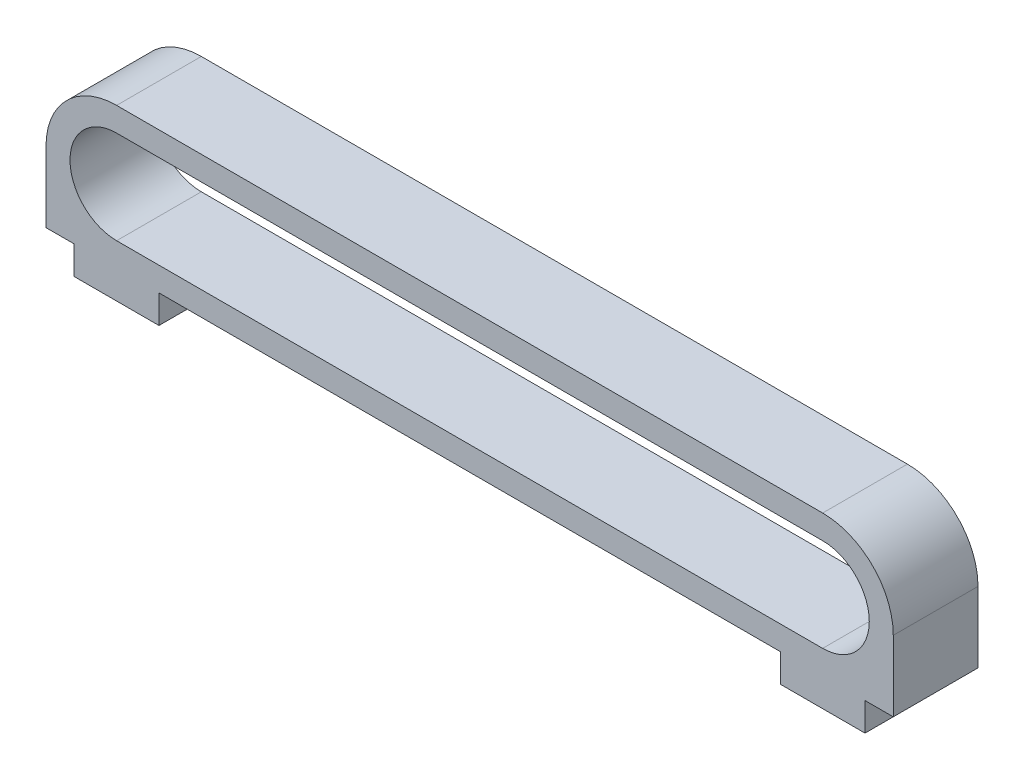
ISO-10303-21;
HEADER;
FILE_DESCRIPTION(('STEP AP214'),'2;1');
FILE_NAME('part.step','',(''),(''),'','','');
FILE_SCHEMA(('AUTOMOTIVE_DESIGN { 1 0 10303 214 1 1 1 1 }'));
ENDSEC;
DATA;
#1=APPLICATION_CONTEXT('core data for automotive mechanical design processes');
#2=APPLICATION_PROTOCOL_DEFINITION('international standard','automotive_design',2000,#1);
#3=PRODUCT_CONTEXT('',#1,'mechanical');
#4=PRODUCT('Part','Part','',(#3));
#5=PRODUCT_RELATED_PRODUCT_CATEGORY('part','',(#4));
#6=PRODUCT_DEFINITION_FORMATION('','',#4);
#7=PRODUCT_DEFINITION_CONTEXT('part definition',#1,'design');
#8=PRODUCT_DEFINITION('design','',#6,#7);
#9=PRODUCT_DEFINITION_SHAPE('','',#8);
#10=(LENGTH_UNIT() NAMED_UNIT(*) SI_UNIT(.MILLI.,.METRE.));
#11=(NAMED_UNIT(*) PLANE_ANGLE_UNIT() SI_UNIT($,.RADIAN.));
#12=(NAMED_UNIT(*) SI_UNIT($,.STERADIAN.) SOLID_ANGLE_UNIT());
#13=UNCERTAINTY_MEASURE_WITH_UNIT(LENGTH_MEASURE(1.E-05),#10,'distance_accuracy_value','');
#14=(GEOMETRIC_REPRESENTATION_CONTEXT(3) GLOBAL_UNCERTAINTY_ASSIGNED_CONTEXT((#13)) GLOBAL_UNIT_ASSIGNED_CONTEXT((#10,
#11,#12)) REPRESENTATION_CONTEXT('',''));
#15=CARTESIAN_POINT('',(0.,0.,0.));
#16=DIRECTION('',(0.,0.,1.));
#17=DIRECTION('',(1.,0.,0.));
#18=AXIS2_PLACEMENT_3D('',#15,#16,#17);
#19=CARTESIAN_POINT('',(-12.5,-2.5,1.5));
#20=DIRECTION('',(0.,1.,0.));
#21=DIRECTION('',(-1.,0.,0.));
#22=AXIS2_PLACEMENT_3D('',#19,#20,#21);
#23=PLANE('',#22);
#24=DIRECTION('',(0.,0.,1.));
#25=VECTOR('',#24,1.);
#26=CARTESIAN_POINT('',(14.,-2.5,1.5));
#27=LINE('',#26,#25);
#28=CARTESIAN_POINT('',(14.,-2.5,-1.5));
#29=VERTEX_POINT('',#28);
#30=CARTESIAN_POINT('',(14.,-2.49999999999999,1.5));
#31=VERTEX_POINT('',#30);
#32=EDGE_CURVE('E181',#29,#31,#27,.T.);
#33=ORIENTED_EDGE('',*,*,#32,.F.);
#34=DIRECTION('',(1.,0.,0.));
#35=VECTOR('',#34,1.);
#36=CARTESIAN_POINT('',(-12.5,-2.5,-1.5));
#37=LINE('',#36,#35);
#38=CARTESIAN_POINT('',(15.,-2.5,-1.5));
#39=VERTEX_POINT('',#38);
#40=EDGE_CURVE('E165',#29,#39,#37,.T.);
#41=ORIENTED_EDGE('',*,*,#40,.T.);
#42=DIRECTION('',(0.,0.,1.));
#43=VECTOR('',#42,1.);
#44=CARTESIAN_POINT('',(15.,-2.5,-1.5));
#45=LINE('',#44,#43);
#46=CARTESIAN_POINT('',(15.,-2.5,1.5));
#47=VERTEX_POINT('',#46);
#48=EDGE_CURVE('E230',#39,#47,#45,.T.);
#49=ORIENTED_EDGE('',*,*,#48,.T.);
#50=DIRECTION('',(1.,0.,0.));
#51=VECTOR('',#50,1.);
#52=CARTESIAN_POINT('',(-12.5,-2.5,1.5));
#53=LINE('',#52,#51);
#54=EDGE_CURVE('E54',#31,#47,#53,.T.);
#55=ORIENTED_EDGE('',*,*,#54,.F.);
#56=EDGE_LOOP('',(#33,#41,#49,#55));
#57=FACE_BOUND('',#56,.T.);
#58=ADVANCED_FACE('F39',(#57),#23,.F.);
#59=DIRECTION('',(0.,0.,-1.));
#60=VECTOR('',#59,1.);
#61=CARTESIAN_POINT('',(11.,-2.5,1.5));
#62=LINE('',#61,#60);
#63=CARTESIAN_POINT('',(11.,-2.5,1.5));
#64=VERTEX_POINT('',#63);
#65=CARTESIAN_POINT('',(11.,-2.5,-1.5));
#66=VERTEX_POINT('',#65);
#67=EDGE_CURVE('E62',#64,#66,#62,.T.);
#68=ORIENTED_EDGE('',*,*,#67,.F.);
#69=CARTESIAN_POINT('',(-11.,-2.5,1.5));
#70=VERTEX_POINT('',#69);
#71=EDGE_CURVE('E289',#70,#64,#53,.T.);
#72=ORIENTED_EDGE('',*,*,#71,.F.);
#73=DIRECTION('',(0.,0.,1.));
#74=VECTOR('',#73,1.);
#75=CARTESIAN_POINT('',(-11.,-2.5,1.5));
#76=LINE('',#75,#74);
#77=CARTESIAN_POINT('',(-11.,-2.5,-1.5));
#78=VERTEX_POINT('',#77);
#79=EDGE_CURVE('E208',#78,#70,#76,.T.);
#80=ORIENTED_EDGE('',*,*,#79,.F.);
#81=EDGE_CURVE('E176',#78,#66,#37,.T.);
#82=ORIENTED_EDGE('',*,*,#81,.T.);
#83=EDGE_LOOP('',(#68,#72,#80,#82));
#84=FACE_BOUND('',#83,.T.);
#85=ADVANCED_FACE('F347',(#84),#23,.F.);
#86=DIRECTION('',(0.,0.,-1.));
#87=VECTOR('',#86,1.);
#88=CARTESIAN_POINT('',(-14.,-2.5,1.5));
#89=LINE('',#88,#87);
#90=CARTESIAN_POINT('',(-14.,-2.5,1.5));
#91=VERTEX_POINT('',#90);
#92=CARTESIAN_POINT('',(-14.,-2.5,-1.5));
#93=VERTEX_POINT('',#92);
#94=EDGE_CURVE('E184',#91,#93,#89,.T.);
#95=ORIENTED_EDGE('',*,*,#94,.F.);
#96=CARTESIAN_POINT('',(-15.,-2.5,1.5));
#97=VERTEX_POINT('',#96);
#98=EDGE_CURVE('E285',#97,#91,#53,.T.);
#99=ORIENTED_EDGE('',*,*,#98,.F.);
#100=DIRECTION('',(0.,0.,1.));
#101=VECTOR('',#100,1.);
#102=CARTESIAN_POINT('',(-15.,-2.5,-1.5));
#103=LINE('',#102,#101);
#104=CARTESIAN_POINT('',(-15.,-2.5,-1.5));
#105=VERTEX_POINT('',#104);
#106=EDGE_CURVE('E245',#105,#97,#103,.T.);
#107=ORIENTED_EDGE('',*,*,#106,.F.);
#108=EDGE_CURVE('E179',#105,#93,#37,.T.);
#109=ORIENTED_EDGE('',*,*,#108,.T.);
#110=EDGE_LOOP('',(#95,#99,#107,#109));
#111=FACE_BOUND('',#110,.T.);
#112=ADVANCED_FACE('F345',(#111),#23,.F.);
#113=CARTESIAN_POINT('',(-12.5,0.,1.5));
#114=DIRECTION('',(0.,0.,-1.));
#115=DIRECTION('',(-1.,0.,0.));
#116=AXIS2_PLACEMENT_3D('',#113,#114,#115);
#117=CYLINDRICAL_SURFACE('',#116,2.5);
#118=DIRECTION('',(0.,0.,1.));
#119=VECTOR('',#118,1.);
#120=CARTESIAN_POINT('',(-15.,0.,-1.5));
#121=LINE('',#120,#119);
#122=CARTESIAN_POINT('',(-15.,0.,-1.5));
#123=VERTEX_POINT('',#122);
#124=CARTESIAN_POINT('',(-15.,0.,1.5));
#125=VERTEX_POINT('',#124);
#126=EDGE_CURVE('E242',#123,#125,#121,.T.);
#127=ORIENTED_EDGE('',*,*,#126,.T.);
#128=CARTESIAN_POINT('',(-12.5,0.,1.5));
#129=DIRECTION('',(0.,0.,1.));
#130=DIRECTION('',(1.,0.,0.));
#131=AXIS2_PLACEMENT_3D('',#128,#129,#130);
#132=CIRCLE('',#131,2.5);
#133=CARTESIAN_POINT('',(-12.5,2.5,1.5));
#134=VERTEX_POINT('',#133);
#135=EDGE_CURVE('E281',#134,#125,#132,.T.);
#136=ORIENTED_EDGE('',*,*,#135,.F.);
#137=DIRECTION('',(0.,0.,-1.));
#138=VECTOR('',#137,1.);
#139=CARTESIAN_POINT('',(-12.5,2.5,1.5));
#140=LINE('',#139,#138);
#141=CARTESIAN_POINT('',(-12.5,2.5,-1.5));
#142=VERTEX_POINT('',#141);
#143=EDGE_CURVE('E47',#134,#142,#140,.T.);
#144=ORIENTED_EDGE('',*,*,#143,.T.);
#145=CARTESIAN_POINT('',(-12.5,0.,-1.5));
#146=DIRECTION('',(0.,0.,1.));
#147=DIRECTION('',(1.,0.,0.));
#148=AXIS2_PLACEMENT_3D('',#145,#146,#147);
#149=CIRCLE('',#148,2.5);
#150=EDGE_CURVE('E177',#142,#123,#149,.T.);
#151=ORIENTED_EDGE('',*,*,#150,.T.);
#152=EDGE_LOOP('',(#127,#136,#144,#151));
#153=FACE_BOUND('',#152,.T.);
#154=ADVANCED_FACE('F41',(#153),#117,.T.);
#155=CARTESIAN_POINT('',(-12.5,0.,1.5));
#156=DIRECTION('',(0.,0.,1.));
#157=DIRECTION('',(1.,0.,0.));
#158=AXIS2_PLACEMENT_3D('',#155,#156,#157);
#159=PLANE('',#158);
#160=ORIENTED_EDGE('',*,*,#135,.T.);
#161=DIRECTION('',(0.,-1.,0.));
#162=VECTOR('',#161,1.);
#163=CARTESIAN_POINT('',(-15.,0.,1.5));
#164=LINE('',#163,#162);
#165=EDGE_CURVE('E237',#125,#97,#164,.T.);
#166=ORIENTED_EDGE('',*,*,#165,.T.);
#167=ORIENTED_EDGE('',*,*,#98,.T.);
#168=DIRECTION('',(0.,1.,0.));
#169=VECTOR('',#168,1.);
#170=CARTESIAN_POINT('',(-14.,-3.5,1.5));
#171=LINE('',#170,#169);
#172=CARTESIAN_POINT('',(-14.,-3.5,1.5));
#173=VERTEX_POINT('',#172);
#174=EDGE_CURVE('E214',#173,#91,#171,.T.);
#175=ORIENTED_EDGE('',*,*,#174,.F.);
#176=DIRECTION('',(-1.,0.,0.));
#177=VECTOR('',#176,1.);
#178=CARTESIAN_POINT('',(-14.,-3.5,1.5));
#179=LINE('',#178,#177);
#180=CARTESIAN_POINT('',(-11.,-3.5,1.5));
#181=VERTEX_POINT('',#180);
#182=EDGE_CURVE('E212',#181,#173,#179,.T.);
#183=ORIENTED_EDGE('',*,*,#182,.F.);
#184=DIRECTION('',(0.,1.,0.));
#185=VECTOR('',#184,1.);
#186=CARTESIAN_POINT('',(-11.,-3.5,1.5));
#187=LINE('',#186,#185);
#188=EDGE_CURVE('E221',#181,#70,#187,.T.);
#189=ORIENTED_EDGE('',*,*,#188,.T.);
#190=ORIENTED_EDGE('',*,*,#71,.T.);
#191=DIRECTION('',(0.,1.,0.));
#192=VECTOR('',#191,1.);
#193=CARTESIAN_POINT('',(11.,-3.5,1.5));
#194=LINE('',#193,#192);
#195=CARTESIAN_POINT('',(11.,-3.5,1.5));
#196=VERTEX_POINT('',#195);
#197=EDGE_CURVE('E195',#196,#64,#194,.T.);
#198=ORIENTED_EDGE('',*,*,#197,.F.);
#199=DIRECTION('',(-1.,0.,0.));
#200=VECTOR('',#199,1.);
#201=CARTESIAN_POINT('',(14.,-3.5,1.5));
#202=LINE('',#201,#200);
#203=CARTESIAN_POINT('',(14.,-3.5,1.5));
#204=VERTEX_POINT('',#203);
#205=EDGE_CURVE('E201',#204,#196,#202,.T.);
#206=ORIENTED_EDGE('',*,*,#205,.F.);
#207=DIRECTION('',(0.,1.,0.));
#208=VECTOR('',#207,1.);
#209=CARTESIAN_POINT('',(14.,-3.5,1.5));
#210=LINE('',#209,#208);
#211=EDGE_CURVE('E320',#204,#31,#210,.T.);
#212=ORIENTED_EDGE('',*,*,#211,.T.);
#213=ORIENTED_EDGE('',*,*,#54,.T.);
#214=DIRECTION('',(0.,1.,0.));
#215=VECTOR('',#214,1.);
#216=CARTESIAN_POINT('',(15.,-2.5,1.5));
#217=LINE('',#216,#215);
#218=CARTESIAN_POINT('',(15.,0.,1.5));
#219=VERTEX_POINT('',#218);
#220=EDGE_CURVE('E235',#47,#219,#217,.T.);
#221=ORIENTED_EDGE('',*,*,#220,.T.);
#222=CARTESIAN_POINT('',(12.5,0.,1.5));
#223=DIRECTION('',(0.,0.,1.));
#224=DIRECTION('',(1.,0.,0.));
#225=AXIS2_PLACEMENT_3D('',#222,#223,#224);
#226=CIRCLE('',#225,2.5);
#227=CARTESIAN_POINT('',(12.5,2.5,1.5));
#228=VERTEX_POINT('',#227);
#229=EDGE_CURVE('E288',#219,#228,#226,.T.);
#230=ORIENTED_EDGE('',*,*,#229,.T.);
#231=DIRECTION('',(-1.,0.,0.));
#232=VECTOR('',#231,1.);
#233=CARTESIAN_POINT('',(-12.5,2.5,1.5));
#234=LINE('',#233,#232);
#235=EDGE_CURVE('E291',#228,#134,#234,.T.);
#236=ORIENTED_EDGE('',*,*,#235,.T.);
#237=EDGE_LOOP('',(#160,#166,#167,#175,#183,#189,#190,#198,#206,#212,#213,#221,#230,#236));
#238=FACE_BOUND('',#237,.T.);
#239=DIRECTION('',(1.,0.,0.));
#240=VECTOR('',#239,1.);
#241=CARTESIAN_POINT('',(-12.5,-1.65,1.5));
#242=LINE('',#241,#240);
#243=CARTESIAN_POINT('',(-12.5,-1.65,1.5));
#244=VERTEX_POINT('',#243);
#245=CARTESIAN_POINT('',(12.5,-1.65,1.5));
#246=VERTEX_POINT('',#245);
#247=EDGE_CURVE('E253',#244,#246,#242,.T.);
#248=ORIENTED_EDGE('',*,*,#247,.F.);
#249=CARTESIAN_POINT('',(-12.5,0.,1.5));
#250=DIRECTION('',(0.,0.,1.));
#251=DIRECTION('',(1.,0.,0.));
#252=AXIS2_PLACEMENT_3D('',#249,#250,#251);
#253=CIRCLE('',#252,1.65);
#254=CARTESIAN_POINT('',(-12.5,1.65,1.5));
#255=VERTEX_POINT('',#254);
#256=EDGE_CURVE('E251',#255,#244,#253,.T.);
#257=ORIENTED_EDGE('',*,*,#256,.F.);
#258=DIRECTION('',(-1.,0.,0.));
#259=VECTOR('',#258,1.);
#260=CARTESIAN_POINT('',(-12.5,1.65,1.5));
#261=LINE('',#260,#259);
#262=CARTESIAN_POINT('',(12.5,1.65,1.5));
#263=VERTEX_POINT('',#262);
#264=EDGE_CURVE('E259',#263,#255,#261,.T.);
#265=ORIENTED_EDGE('',*,*,#264,.F.);
#266=CARTESIAN_POINT('',(12.5,0.,1.5));
#267=DIRECTION('',(0.,0.,1.));
#268=DIRECTION('',(1.,0.,0.));
#269=AXIS2_PLACEMENT_3D('',#266,#267,#268);
#270=CIRCLE('',#269,1.65);
#271=EDGE_CURVE('E256',#246,#263,#270,.T.);
#272=ORIENTED_EDGE('',*,*,#271,.F.);
#273=EDGE_LOOP('',(#248,#257,#265,#272));
#274=FACE_BOUND('',#273,.T.);
#275=ADVANCED_FACE('F309',(#238,#274),#159,.T.);
#276=CARTESIAN_POINT('',(-12.5,0.,-1.5));
#277=DIRECTION('',(0.,0.,1.));
#278=DIRECTION('',(1.,0.,0.));
#279=AXIS2_PLACEMENT_3D('',#276,#277,#278);
#280=PLANE('',#279);
#281=ORIENTED_EDGE('',*,*,#150,.F.);
#282=DIRECTION('',(-1.,0.,0.));
#283=VECTOR('',#282,1.);
#284=CARTESIAN_POINT('',(-12.5,2.5,-1.5));
#285=LINE('',#284,#283);
#286=CARTESIAN_POINT('',(12.5,2.5,-1.5));
#287=VERTEX_POINT('',#286);
#288=EDGE_CURVE('E284',#287,#142,#285,.T.);
#289=ORIENTED_EDGE('',*,*,#288,.F.);
#290=CARTESIAN_POINT('',(12.5,0.,-1.5));
#291=DIRECTION('',(0.,0.,1.));
#292=DIRECTION('',(1.,0.,0.));
#293=AXIS2_PLACEMENT_3D('',#290,#291,#292);
#294=CIRCLE('',#293,2.5);
#295=CARTESIAN_POINT('',(15.,0.,-1.5));
#296=VERTEX_POINT('',#295);
#297=EDGE_CURVE('E295',#296,#287,#294,.T.);
#298=ORIENTED_EDGE('',*,*,#297,.F.);
#299=DIRECTION('',(0.,1.,0.));
#300=VECTOR('',#299,1.);
#301=CARTESIAN_POINT('',(15.,-2.5,-1.5));
#302=LINE('',#301,#300);
#303=EDGE_CURVE('E174',#39,#296,#302,.T.);
#304=ORIENTED_EDGE('',*,*,#303,.F.);
#305=ORIENTED_EDGE('',*,*,#40,.F.);
#306=DIRECTION('',(0.,1.,0.));
#307=VECTOR('',#306,1.);
#308=CARTESIAN_POINT('',(14.,-3.5,-1.5));
#309=LINE('',#308,#307);
#310=CARTESIAN_POINT('',(14.,-3.5,-1.5));
#311=VERTEX_POINT('',#310);
#312=EDGE_CURVE('E171',#311,#29,#309,.T.);
#313=ORIENTED_EDGE('',*,*,#312,.F.);
#314=DIRECTION('',(1.,0.,0.));
#315=VECTOR('',#314,1.);
#316=CARTESIAN_POINT('',(14.,-3.5,-1.5));
#317=LINE('',#316,#315);
#318=CARTESIAN_POINT('',(11.,-3.5,-1.5));
#319=VERTEX_POINT('',#318);
#320=EDGE_CURVE('E189',#319,#311,#317,.T.);
#321=ORIENTED_EDGE('',*,*,#320,.F.);
#322=DIRECTION('',(0.,1.,0.));
#323=VECTOR('',#322,1.);
#324=CARTESIAN_POINT('',(11.,-3.5,-1.5));
#325=LINE('',#324,#323);
#326=EDGE_CURVE('E190',#319,#66,#325,.T.);
#327=ORIENTED_EDGE('',*,*,#326,.T.);
#328=ORIENTED_EDGE('',*,*,#81,.F.);
#329=DIRECTION('',(0.,1.,0.));
#330=VECTOR('',#329,1.);
#331=CARTESIAN_POINT('',(-11.,-3.5,-1.5));
#332=LINE('',#331,#330);
#333=CARTESIAN_POINT('',(-11.,-3.5,-1.5));
#334=VERTEX_POINT('',#333);
#335=EDGE_CURVE('E224',#334,#78,#332,.T.);
#336=ORIENTED_EDGE('',*,*,#335,.F.);
#337=DIRECTION('',(1.,0.,0.));
#338=VECTOR('',#337,1.);
#339=CARTESIAN_POINT('',(-14.,-3.5,-1.5));
#340=LINE('',#339,#338);
#341=CARTESIAN_POINT('',(-14.,-3.5,-1.5));
#342=VERTEX_POINT('',#341);
#343=EDGE_CURVE('E207',#342,#334,#340,.T.);
#344=ORIENTED_EDGE('',*,*,#343,.F.);
#345=DIRECTION('',(0.,1.,0.));
#346=VECTOR('',#345,1.);
#347=CARTESIAN_POINT('',(-14.,-3.5,-1.5));
#348=LINE('',#347,#346);
#349=EDGE_CURVE('E227',#342,#93,#348,.T.);
#350=ORIENTED_EDGE('',*,*,#349,.T.);
#351=ORIENTED_EDGE('',*,*,#108,.F.);
#352=DIRECTION('',(0.,-1.,0.));
#353=VECTOR('',#352,1.);
#354=CARTESIAN_POINT('',(-15.,0.,-1.5));
#355=LINE('',#354,#353);
#356=EDGE_CURVE('E239',#123,#105,#355,.T.);
#357=ORIENTED_EDGE('',*,*,#356,.F.);
#358=EDGE_LOOP('',(#281,#289,#298,#304,#305,#313,#321,#327,#328,#336,#344,#350,#351,#357));
#359=FACE_BOUND('',#358,.T.);
#360=CARTESIAN_POINT('',(-12.5,0.,-1.5));
#361=DIRECTION('',(0.,0.,1.));
#362=DIRECTION('',(1.,0.,0.));
#363=AXIS2_PLACEMENT_3D('',#360,#361,#362);
#364=CIRCLE('',#363,1.65);
#365=CARTESIAN_POINT('',(-12.5,1.65,-1.5));
#366=VERTEX_POINT('',#365);
#367=CARTESIAN_POINT('',(-12.5,-1.65,-1.5));
#368=VERTEX_POINT('',#367);
#369=EDGE_CURVE('E248',#366,#368,#364,.T.);
#370=ORIENTED_EDGE('',*,*,#369,.T.);
#371=DIRECTION('',(1.,0.,0.));
#372=VECTOR('',#371,1.);
#373=CARTESIAN_POINT('',(-12.5,-1.65,-1.5));
#374=LINE('',#373,#372);
#375=CARTESIAN_POINT('',(12.5,-1.65,-1.5));
#376=VERTEX_POINT('',#375);
#377=EDGE_CURVE('E264',#368,#376,#374,.T.);
#378=ORIENTED_EDGE('',*,*,#377,.T.);
#379=CARTESIAN_POINT('',(12.5,0.,-1.5));
#380=DIRECTION('',(0.,0.,1.));
#381=DIRECTION('',(1.,0.,0.));
#382=AXIS2_PLACEMENT_3D('',#379,#380,#381);
#383=CIRCLE('',#382,1.65);
#384=CARTESIAN_POINT('',(12.5,1.65,-1.5));
#385=VERTEX_POINT('',#384);
#386=EDGE_CURVE('E267',#376,#385,#383,.T.);
#387=ORIENTED_EDGE('',*,*,#386,.T.);
#388=DIRECTION('',(-1.,0.,0.));
#389=VECTOR('',#388,1.);
#390=CARTESIAN_POINT('',(-12.5,1.65,-1.5));
#391=LINE('',#390,#389);
#392=EDGE_CURVE('E254',#385,#366,#391,.T.);
#393=ORIENTED_EDGE('',*,*,#392,.T.);
#394=EDGE_LOOP('',(#370,#378,#387,#393));
#395=FACE_BOUND('',#394,.T.);
#396=ADVANCED_FACE('F167',(#359,#395),#280,.F.);
#397=CARTESIAN_POINT('',(12.5,0.,1.5));
#398=DIRECTION('',(0.,0.,-1.));
#399=DIRECTION('',(-1.,0.,0.));
#400=AXIS2_PLACEMENT_3D('',#397,#398,#399);
#401=CYLINDRICAL_SURFACE('',#400,2.5);
#402=ORIENTED_EDGE('',*,*,#229,.F.);
#403=DIRECTION('',(0.,0.,1.));
#404=VECTOR('',#403,1.);
#405=CARTESIAN_POINT('',(15.,0.,-1.5));
#406=LINE('',#405,#404);
#407=EDGE_CURVE('E231',#296,#219,#406,.T.);
#408=ORIENTED_EDGE('',*,*,#407,.F.);
#409=ORIENTED_EDGE('',*,*,#297,.T.);
#410=DIRECTION('',(0.,0.,-1.));
#411=VECTOR('',#410,1.);
#412=CARTESIAN_POINT('',(12.5,2.5,1.5));
#413=LINE('',#412,#411);
#414=EDGE_CURVE('E11',#228,#287,#413,.T.);
#415=ORIENTED_EDGE('',*,*,#414,.F.);
#416=EDGE_LOOP('',(#402,#408,#409,#415));
#417=FACE_BOUND('',#416,.T.);
#418=ADVANCED_FACE('F315',(#417),#401,.T.);
#419=CARTESIAN_POINT('',(-12.5,2.5,1.5));
#420=DIRECTION('',(0.,-1.,0.));
#421=DIRECTION('',(1.,0.,0.));
#422=AXIS2_PLACEMENT_3D('',#419,#420,#421);
#423=PLANE('',#422);
#424=ORIENTED_EDGE('',*,*,#288,.T.);
#425=ORIENTED_EDGE('',*,*,#143,.F.);
#426=ORIENTED_EDGE('',*,*,#235,.F.);
#427=ORIENTED_EDGE('',*,*,#414,.T.);
#428=EDGE_LOOP('',(#424,#425,#426,#427));
#429=FACE_BOUND('',#428,.T.);
#430=ADVANCED_FACE('F313',(#429),#423,.F.);
#431=CARTESIAN_POINT('',(-12.5,0.,1.5));
#432=DIRECTION('',(0.,0.,-1.));
#433=DIRECTION('',(-1.,0.,0.));
#434=AXIS2_PLACEMENT_3D('',#431,#432,#433);
#435=CYLINDRICAL_SURFACE('',#434,1.65);
#436=ORIENTED_EDGE('',*,*,#369,.F.);
#437=DIRECTION('',(0.,0.,-1.));
#438=VECTOR('',#437,1.);
#439=CARTESIAN_POINT('',(-12.5,1.65,1.5));
#440=LINE('',#439,#438);
#441=EDGE_CURVE('E261',#255,#366,#440,.T.);
#442=ORIENTED_EDGE('',*,*,#441,.F.);
#443=ORIENTED_EDGE('',*,*,#256,.T.);
#444=DIRECTION('',(0.,0.,-1.));
#445=VECTOR('',#444,1.);
#446=CARTESIAN_POINT('',(-12.5,-1.65,1.5));
#447=LINE('',#446,#445);
#448=EDGE_CURVE('E278',#244,#368,#447,.T.);
#449=ORIENTED_EDGE('',*,*,#448,.T.);
#450=EDGE_LOOP('',(#436,#442,#443,#449));
#451=FACE_BOUND('',#450,.T.);
#452=ADVANCED_FACE('F405',(#451),#435,.F.);
#453=CARTESIAN_POINT('',(-12.5,-1.65,1.5));
#454=DIRECTION('',(0.,1.,0.));
#455=DIRECTION('',(-1.,0.,0.));
#456=AXIS2_PLACEMENT_3D('',#453,#454,#455);
#457=PLANE('',#456);
#458=ORIENTED_EDGE('',*,*,#377,.F.);
#459=ORIENTED_EDGE('',*,*,#448,.F.);
#460=ORIENTED_EDGE('',*,*,#247,.T.);
#461=DIRECTION('',(0.,0.,-1.));
#462=VECTOR('',#461,1.);
#463=CARTESIAN_POINT('',(12.5,-1.65,1.5));
#464=LINE('',#463,#462);
#465=EDGE_CURVE('E276',#246,#376,#464,.T.);
#466=ORIENTED_EDGE('',*,*,#465,.T.);
#467=EDGE_LOOP('',(#458,#459,#460,#466));
#468=FACE_BOUND('',#467,.T.);
#469=ADVANCED_FACE('F414',(#468),#457,.T.);
#470=CARTESIAN_POINT('',(12.5,0.,1.5));
#471=DIRECTION('',(0.,0.,-1.));
#472=DIRECTION('',(-1.,0.,0.));
#473=AXIS2_PLACEMENT_3D('',#470,#471,#472);
#474=CYLINDRICAL_SURFACE('',#473,1.65);
#475=ORIENTED_EDGE('',*,*,#386,.F.);
#476=ORIENTED_EDGE('',*,*,#465,.F.);
#477=ORIENTED_EDGE('',*,*,#271,.T.);
#478=DIRECTION('',(0.,0.,-1.));
#479=VECTOR('',#478,1.);
#480=CARTESIAN_POINT('',(12.5,1.65,1.5));
#481=LINE('',#480,#479);
#482=EDGE_CURVE('E274',#263,#385,#481,.T.);
#483=ORIENTED_EDGE('',*,*,#482,.T.);
#484=EDGE_LOOP('',(#475,#476,#477,#483));
#485=FACE_BOUND('',#484,.T.);
#486=ADVANCED_FACE('F424',(#485),#474,.F.);
#487=CARTESIAN_POINT('',(-12.5,1.65,1.5));
#488=DIRECTION('',(0.,-1.,0.));
#489=DIRECTION('',(1.,0.,0.));
#490=AXIS2_PLACEMENT_3D('',#487,#488,#489);
#491=PLANE('',#490);
#492=ORIENTED_EDGE('',*,*,#392,.F.);
#493=ORIENTED_EDGE('',*,*,#482,.F.);
#494=ORIENTED_EDGE('',*,*,#264,.T.);
#495=ORIENTED_EDGE('',*,*,#441,.T.);
#496=EDGE_LOOP('',(#492,#493,#494,#495));
#497=FACE_BOUND('',#496,.T.);
#498=ADVANCED_FACE('F434',(#497),#491,.T.);
#499=CARTESIAN_POINT('',(-15.,0.,-1.5));
#500=DIRECTION('',(-1.,0.,0.));
#501=DIRECTION('',(0.,0.,1.));
#502=AXIS2_PLACEMENT_3D('',#499,#500,#501);
#503=PLANE('',#502);
#504=ORIENTED_EDGE('',*,*,#165,.F.);
#505=ORIENTED_EDGE('',*,*,#126,.F.);
#506=ORIENTED_EDGE('',*,*,#356,.T.);
#507=ORIENTED_EDGE('',*,*,#106,.T.);
#508=EDGE_LOOP('',(#504,#505,#506,#507));
#509=FACE_BOUND('',#508,.T.);
#510=ADVANCED_FACE('F307',(#509),#503,.T.);
#511=CARTESIAN_POINT('',(15.,-2.5,-1.5));
#512=DIRECTION('',(1.,0.,0.));
#513=DIRECTION('',(0.,0.,-1.));
#514=AXIS2_PLACEMENT_3D('',#511,#512,#513);
#515=PLANE('',#514);
#516=ORIENTED_EDGE('',*,*,#220,.F.);
#517=ORIENTED_EDGE('',*,*,#48,.F.);
#518=ORIENTED_EDGE('',*,*,#303,.T.);
#519=ORIENTED_EDGE('',*,*,#407,.T.);
#520=EDGE_LOOP('',(#516,#517,#518,#519));
#521=FACE_BOUND('',#520,.T.);
#522=ADVANCED_FACE('F319',(#521),#515,.T.);
#523=CARTESIAN_POINT('',(-14.,-3.5,1.5));
#524=DIRECTION('',(1.,0.,0.));
#525=DIRECTION('',(0.,1.,0.));
#526=AXIS2_PLACEMENT_3D('',#523,#524,#525);
#527=PLANE('',#526);
#528=ORIENTED_EDGE('',*,*,#94,.T.);
#529=ORIENTED_EDGE('',*,*,#349,.F.);
#530=DIRECTION('',(0.,0.,-1.));
#531=VECTOR('',#530,1.);
#532=CARTESIAN_POINT('',(-14.,-3.5,1.5));
#533=LINE('',#532,#531);
#534=EDGE_CURVE('E204',#173,#342,#533,.T.);
#535=ORIENTED_EDGE('',*,*,#534,.F.);
#536=ORIENTED_EDGE('',*,*,#174,.T.);
#537=EDGE_LOOP('',(#528,#529,#535,#536));
#538=FACE_BOUND('',#537,.T.);
#539=ADVANCED_FACE('F343',(#538),#527,.F.);
#540=CARTESIAN_POINT('',(-11.,-3.5,1.5));
#541=DIRECTION('',(-1.,0.,0.));
#542=DIRECTION('',(0.,-1.,0.));
#543=AXIS2_PLACEMENT_3D('',#540,#541,#542);
#544=PLANE('',#543);
#545=ORIENTED_EDGE('',*,*,#79,.T.);
#546=ORIENTED_EDGE('',*,*,#188,.F.);
#547=DIRECTION('',(0.,0.,1.));
#548=VECTOR('',#547,1.);
#549=CARTESIAN_POINT('',(-11.,-3.5,1.5));
#550=LINE('',#549,#548);
#551=EDGE_CURVE('E210',#334,#181,#550,.T.);
#552=ORIENTED_EDGE('',*,*,#551,.F.);
#553=ORIENTED_EDGE('',*,*,#335,.T.);
#554=EDGE_LOOP('',(#545,#546,#552,#553));
#555=FACE_BOUND('',#554,.T.);
#556=ADVANCED_FACE('F336',(#555),#544,.F.);
#557=CARTESIAN_POINT('',(0.,-3.5,0.));
#558=DIRECTION('',(0.,-1.,0.));
#559=DIRECTION('',(1.,0.,0.));
#560=AXIS2_PLACEMENT_3D('',#557,#558,#559);
#561=PLANE('',#560);
#562=ORIENTED_EDGE('',*,*,#534,.T.);
#563=ORIENTED_EDGE('',*,*,#343,.T.);
#564=ORIENTED_EDGE('',*,*,#551,.T.);
#565=ORIENTED_EDGE('',*,*,#182,.T.);
#566=EDGE_LOOP('',(#562,#563,#564,#565));
#567=FACE_BOUND('',#566,.T.);
#568=ADVANCED_FACE('F338',(#567),#561,.T.);
#569=CARTESIAN_POINT('',(14.,-3.5,1.5));
#570=DIRECTION('',(-1.,0.,0.));
#571=DIRECTION('',(0.,-1.,0.));
#572=AXIS2_PLACEMENT_3D('',#569,#570,#571);
#573=PLANE('',#572);
#574=ORIENTED_EDGE('',*,*,#32,.T.);
#575=ORIENTED_EDGE('',*,*,#211,.F.);
#576=DIRECTION('',(0.,0.,1.));
#577=VECTOR('',#576,1.);
#578=CARTESIAN_POINT('',(14.,-3.5,1.5));
#579=LINE('',#578,#577);
#580=EDGE_CURVE('E188',#311,#204,#579,.T.);
#581=ORIENTED_EDGE('',*,*,#580,.F.);
#582=ORIENTED_EDGE('',*,*,#312,.T.);
#583=EDGE_LOOP('',(#574,#575,#581,#582));
#584=FACE_BOUND('',#583,.T.);
#585=ADVANCED_FACE('F186',(#584),#573,.F.);
#586=CARTESIAN_POINT('',(11.,-3.5,1.5));
#587=DIRECTION('',(1.,0.,0.));
#588=DIRECTION('',(0.,1.,0.));
#589=AXIS2_PLACEMENT_3D('',#586,#587,#588);
#590=PLANE('',#589);
#591=ORIENTED_EDGE('',*,*,#67,.T.);
#592=ORIENTED_EDGE('',*,*,#326,.F.);
#593=DIRECTION('',(0.,0.,-1.));
#594=VECTOR('',#593,1.);
#595=CARTESIAN_POINT('',(11.,-3.5,1.5));
#596=LINE('',#595,#594);
#597=EDGE_CURVE('E192',#196,#319,#596,.T.);
#598=ORIENTED_EDGE('',*,*,#597,.F.);
#599=ORIENTED_EDGE('',*,*,#197,.T.);
#600=EDGE_LOOP('',(#591,#592,#598,#599));
#601=FACE_BOUND('',#600,.T.);
#602=ADVANCED_FACE('F327',(#601),#590,.F.);
#603=CARTESIAN_POINT('',(0.,-3.5,0.));
#604=DIRECTION('',(0.,1.,0.));
#605=DIRECTION('',(-1.,0.,0.));
#606=AXIS2_PLACEMENT_3D('',#603,#604,#605);
#607=PLANE('',#606);
#608=ORIENTED_EDGE('',*,*,#580,.T.);
#609=ORIENTED_EDGE('',*,*,#205,.T.);
#610=ORIENTED_EDGE('',*,*,#597,.T.);
#611=ORIENTED_EDGE('',*,*,#320,.T.);
#612=EDGE_LOOP('',(#608,#609,#610,#611));
#613=FACE_BOUND('',#612,.T.);
#614=ADVANCED_FACE('F331',(#613),#607,.F.);
#615=CLOSED_SHELL('',(#58,#85,#112,#154,#275,#396,#418,#430,#452,#469,#486,#498,#510,#522,#539,
#556,#568,#585,#602,#614));
#616=MANIFOLD_SOLID_BREP('B2',#615);
#617=ADVANCED_BREP_SHAPE_REPRESENTATION('',(#18,#616),#14);
#618=SHAPE_DEFINITION_REPRESENTATION(#9,#617);
ENDSEC;
END-ISO-10303-21;
